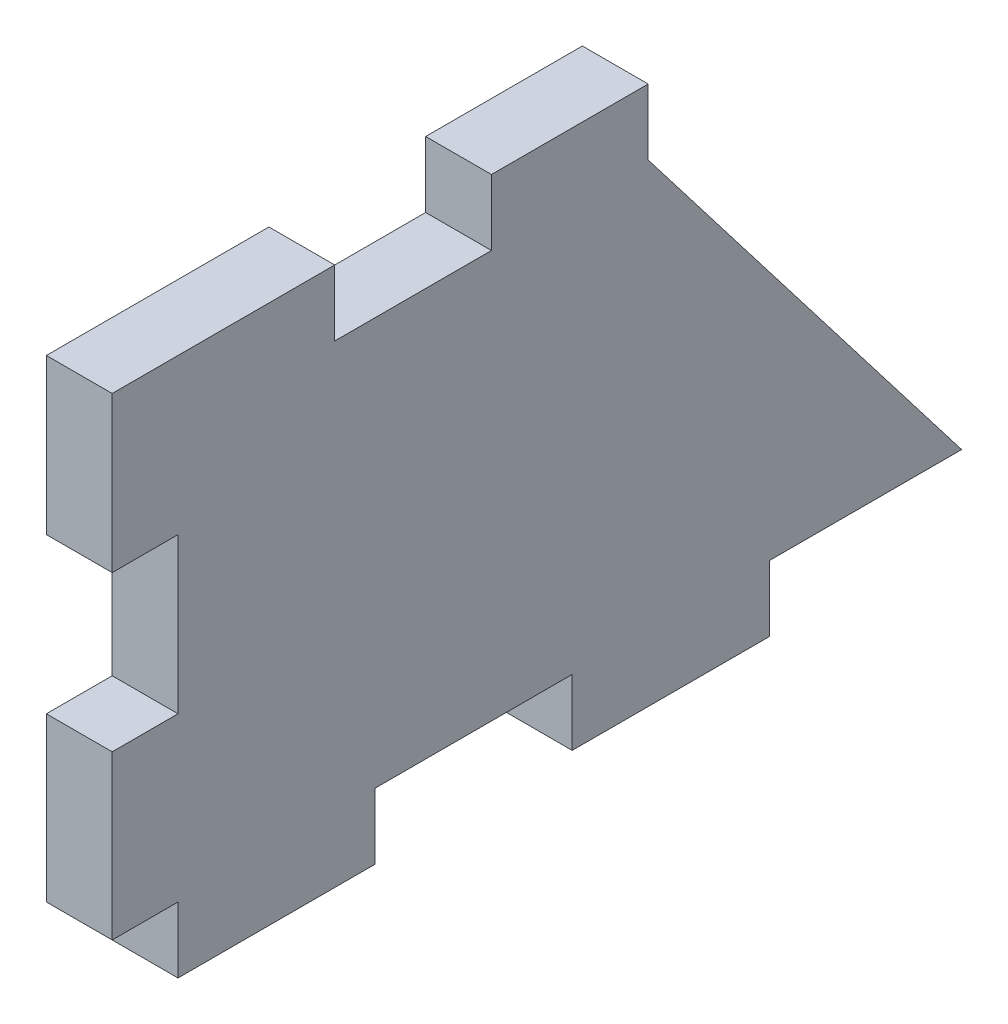
ISO-10303-21;
HEADER;
FILE_DESCRIPTION(('STEP AP214'),'2;1');
FILE_NAME('part.step','',(''),(''),'','','');
FILE_SCHEMA(('AUTOMOTIVE_DESIGN { 1 0 10303 214 1 1 1 1 }'));
ENDSEC;
DATA;
#1=APPLICATION_CONTEXT('core data for automotive mechanical design processes');
#2=APPLICATION_PROTOCOL_DEFINITION('international standard','automotive_design',2000,#1);
#3=PRODUCT_CONTEXT('',#1,'mechanical');
#4=PRODUCT('Part','Part','',(#3));
#5=PRODUCT_RELATED_PRODUCT_CATEGORY('part','',(#4));
#6=PRODUCT_DEFINITION_FORMATION('','',#4);
#7=PRODUCT_DEFINITION_CONTEXT('part definition',#1,'design');
#8=PRODUCT_DEFINITION('design','',#6,#7);
#9=PRODUCT_DEFINITION_SHAPE('','',#8);
#10=(LENGTH_UNIT() NAMED_UNIT(*) SI_UNIT(.MILLI.,.METRE.));
#11=(NAMED_UNIT(*) PLANE_ANGLE_UNIT() SI_UNIT($,.RADIAN.));
#12=(NAMED_UNIT(*) SI_UNIT($,.STERADIAN.) SOLID_ANGLE_UNIT());
#13=UNCERTAINTY_MEASURE_WITH_UNIT(LENGTH_MEASURE(1.E-05),#10,'distance_accuracy_value','');
#14=(GEOMETRIC_REPRESENTATION_CONTEXT(3) GLOBAL_UNCERTAINTY_ASSIGNED_CONTEXT((#13)) GLOBAL_UNIT_ASSIGNED_CONTEXT((#10,
#11,#12)) REPRESENTATION_CONTEXT('',''));
#15=CARTESIAN_POINT('',(0.,0.,0.));
#16=DIRECTION('',(0.,0.,1.));
#17=DIRECTION('',(1.,0.,0.));
#18=AXIS2_PLACEMENT_3D('',#15,#16,#17);
#19=CARTESIAN_POINT('',(5.334,-15.875,37.084));
#20=DIRECTION('',(0.,0.,1.));
#21=DIRECTION('',(1.,0.,0.));
#22=AXIS2_PLACEMENT_3D('',#19,#20,#21);
#23=PLANE('',#22);
#24=DIRECTION('',(-1.,0.,0.));
#25=VECTOR('',#24,1.);
#26=CARTESIAN_POINT('',(5.334,9.27099999999999,37.084));
#27=LINE('',#26,#25);
#28=CARTESIAN_POINT('',(5.334,9.27099999999999,37.084));
#29=VERTEX_POINT('',#28);
#30=CARTESIAN_POINT('',(0.,9.27099999999999,37.084));
#31=VERTEX_POINT('',#30);
#32=EDGE_CURVE('E44',#29,#31,#27,.T.);
#33=ORIENTED_EDGE('',*,*,#32,.F.);
#34=DIRECTION('',(0.,1.,0.));
#35=VECTOR('',#34,1.);
#36=CARTESIAN_POINT('',(5.334,-15.875,37.084));
#37=LINE('',#36,#35);
#38=CARTESIAN_POINT('',(5.334,21.844,37.084));
#39=VERTEX_POINT('',#38);
#40=EDGE_CURVE('E187',#29,#39,#37,.T.);
#41=ORIENTED_EDGE('',*,*,#40,.T.);
#42=DIRECTION('',(1.,0.,0.));
#43=VECTOR('',#42,1.);
#44=CARTESIAN_POINT('',(0.,21.844,37.084));
#45=LINE('',#44,#43);
#46=CARTESIAN_POINT('',(0.,21.844,37.084));
#47=VERTEX_POINT('',#46);
#48=EDGE_CURVE('E203',#47,#39,#45,.T.);
#49=ORIENTED_EDGE('',*,*,#48,.F.);
#50=DIRECTION('',(0.,1.,0.));
#51=VECTOR('',#50,1.);
#52=CARTESIAN_POINT('',(0.,-15.875,37.084));
#53=LINE('',#52,#51);
#54=EDGE_CURVE('E188',#31,#47,#53,.T.);
#55=ORIENTED_EDGE('',*,*,#54,.F.);
#56=EDGE_LOOP('',(#33,#41,#49,#55));
#57=FACE_BOUND('',#56,.T.);
#58=ADVANCED_FACE('F34',(#57),#23,.T.);
#59=CARTESIAN_POINT('',(5.334,-16.51,31.75));
#60=DIRECTION('',(0.,1.,0.));
#61=DIRECTION('',(0.,0.,1.));
#62=AXIS2_PLACEMENT_3D('',#59,#60,#61);
#63=PLANE('',#62);
#64=DIRECTION('',(0.,0.,-1.));
#65=VECTOR('',#64,1.);
#66=CARTESIAN_POINT('',(0.,-16.51,31.75));
#67=LINE('',#66,#65);
#68=CARTESIAN_POINT('',(0.,-16.51,15.7786782170306));
#69=VERTEX_POINT('',#68);
#70=CARTESIAN_POINT('',(0.,-16.51,-0.192643565938809));
#71=VERTEX_POINT('',#70);
#72=EDGE_CURVE('E284',#69,#71,#67,.T.);
#73=ORIENTED_EDGE('',*,*,#72,.T.);
#74=DIRECTION('',(-1.,0.,0.));
#75=VECTOR('',#74,1.);
#76=CARTESIAN_POINT('',(5.334,-16.51,-0.192643565938809));
#77=LINE('',#76,#75);
#78=CARTESIAN_POINT('',(5.334,-16.51,-0.192643565938809));
#79=VERTEX_POINT('',#78);
#80=EDGE_CURVE('E236',#79,#71,#77,.T.);
#81=ORIENTED_EDGE('',*,*,#80,.F.);
#82=DIRECTION('',(0.,0.,-1.));
#83=VECTOR('',#82,1.);
#84=CARTESIAN_POINT('',(5.334,-16.51,31.75));
#85=LINE('',#84,#83);
#86=CARTESIAN_POINT('',(5.334,-16.51,15.7786782170306));
#87=VERTEX_POINT('',#86);
#88=EDGE_CURVE('E302',#87,#79,#85,.T.);
#89=ORIENTED_EDGE('',*,*,#88,.F.);
#90=DIRECTION('',(-1.,0.,0.));
#91=VECTOR('',#90,1.);
#92=CARTESIAN_POINT('',(5.334,-16.51,15.7786782170306));
#93=LINE('',#92,#91);
#94=EDGE_CURVE('E257',#87,#69,#93,.T.);
#95=ORIENTED_EDGE('',*,*,#94,.T.);
#96=EDGE_LOOP('',(#73,#81,#89,#95));
#97=FACE_BOUND('',#96,.T.);
#98=ADVANCED_FACE('F393',(#97),#63,.F.);
#99=CARTESIAN_POINT('',(5.334,16.51,31.75));
#100=DIRECTION('',(0.,-1.,0.));
#101=DIRECTION('',(0.,0.,-1.));
#102=AXIS2_PLACEMENT_3D('',#99,#100,#101);
#103=PLANE('',#102);
#104=DIRECTION('',(0.,0.,1.));
#105=VECTOR('',#104,1.);
#106=CARTESIAN_POINT('',(5.334,16.51,31.75));
#107=LINE('',#106,#105);
#108=CARTESIAN_POINT('',(5.334,16.51,6.35000000000001));
#109=VERTEX_POINT('',#108);
#110=CARTESIAN_POINT('',(5.334,16.51,19.05));
#111=VERTEX_POINT('',#110);
#112=EDGE_CURVE('E299',#109,#111,#107,.T.);
#113=ORIENTED_EDGE('',*,*,#112,.F.);
#114=DIRECTION('',(-1.,0.,0.));
#115=VECTOR('',#114,1.);
#116=CARTESIAN_POINT('',(5.334,16.51,6.35000000000001));
#117=LINE('',#116,#115);
#118=CARTESIAN_POINT('',(0.,16.51,6.35000000000001));
#119=VERTEX_POINT('',#118);
#120=EDGE_CURVE('E362',#109,#119,#117,.T.);
#121=ORIENTED_EDGE('',*,*,#120,.T.);
#122=DIRECTION('',(0.,0.,1.));
#123=VECTOR('',#122,1.);
#124=CARTESIAN_POINT('',(0.,16.51,31.75));
#125=LINE('',#124,#123);
#126=CARTESIAN_POINT('',(0.,16.51,19.05));
#127=VERTEX_POINT('',#126);
#128=EDGE_CURVE('E308',#119,#127,#125,.T.);
#129=ORIENTED_EDGE('',*,*,#128,.T.);
#130=DIRECTION('',(-1.,0.,0.));
#131=VECTOR('',#130,1.);
#132=CARTESIAN_POINT('',(5.334,16.51,19.05));
#133=LINE('',#132,#131);
#134=EDGE_CURVE('E323',#111,#127,#133,.T.);
#135=ORIENTED_EDGE('',*,*,#134,.F.);
#136=EDGE_LOOP('',(#113,#121,#129,#135));
#137=FACE_BOUND('',#136,.T.);
#138=ADVANCED_FACE('F36',(#137),#103,.F.);
#139=CARTESIAN_POINT('',(5.334,-16.51,31.75));
#140=DIRECTION('',(0.,0.,-1.));
#141=DIRECTION('',(-1.,0.,0.));
#142=AXIS2_PLACEMENT_3D('',#139,#140,#141);
#143=PLANE('',#142);
#144=DIRECTION('',(0.,-1.,0.));
#145=VECTOR('',#144,1.);
#146=CARTESIAN_POINT('',(5.334,-16.51,31.75));
#147=LINE('',#146,#145);
#148=CARTESIAN_POINT('',(5.334,-16.51,31.75));
#149=VERTEX_POINT('',#148);
#150=CARTESIAN_POINT('',(5.334,-21.844,31.75));
#151=VERTEX_POINT('',#150);
#152=EDGE_CURVE('E38',#149,#151,#147,.T.);
#153=ORIENTED_EDGE('',*,*,#152,.F.);
#154=DIRECTION('',(1.,0.,0.));
#155=VECTOR('',#154,1.);
#156=CARTESIAN_POINT('',(0.,-16.51,31.75));
#157=LINE('',#156,#155);
#158=CARTESIAN_POINT('',(0.,-16.51,31.75));
#159=VERTEX_POINT('',#158);
#160=EDGE_CURVE('E55',#159,#149,#157,.T.);
#161=ORIENTED_EDGE('',*,*,#160,.F.);
#162=DIRECTION('',(0.,-1.,0.));
#163=VECTOR('',#162,1.);
#164=CARTESIAN_POINT('',(0.,-16.51,31.75));
#165=LINE('',#164,#163);
#166=CARTESIAN_POINT('',(0.,-21.844,31.75));
#167=VERTEX_POINT('',#166);
#168=EDGE_CURVE('E199',#159,#167,#165,.T.);
#169=ORIENTED_EDGE('',*,*,#168,.T.);
#170=DIRECTION('',(-1.,0.,0.));
#171=VECTOR('',#170,1.);
#172=CARTESIAN_POINT('',(5.334,-21.844,31.75));
#173=LINE('',#172,#171);
#174=EDGE_CURVE('E261',#151,#167,#173,.T.);
#175=ORIENTED_EDGE('',*,*,#174,.F.);
#176=EDGE_LOOP('',(#153,#161,#169,#175));
#177=FACE_BOUND('',#176,.T.);
#178=ADVANCED_FACE('F381',(#177),#143,.F.);
#179=CARTESIAN_POINT('',(5.334,-16.51,-16.1639653489082));
#180=VERTEX_POINT('',#179);
#181=CARTESIAN_POINT('',(5.334,-16.51,-31.75));
#182=VERTEX_POINT('',#181);
#183=EDGE_CURVE('E285',#180,#182,#85,.T.);
#184=ORIENTED_EDGE('',*,*,#183,.F.);
#185=DIRECTION('',(-1.,0.,0.));
#186=VECTOR('',#185,1.);
#187=CARTESIAN_POINT('',(5.334,-16.51,-16.1639653489082));
#188=LINE('',#187,#186);
#189=CARTESIAN_POINT('',(0.,-16.51,-16.1639653489082));
#190=VERTEX_POINT('',#189);
#191=EDGE_CURVE('E249',#180,#190,#188,.T.);
#192=ORIENTED_EDGE('',*,*,#191,.T.);
#193=CARTESIAN_POINT('',(0.,-16.51,-31.75));
#194=VERTEX_POINT('',#193);
#195=EDGE_CURVE('E281',#190,#194,#67,.T.);
#196=ORIENTED_EDGE('',*,*,#195,.T.);
#197=DIRECTION('',(-1.,0.,0.));
#198=VECTOR('',#197,1.);
#199=CARTESIAN_POINT('',(5.334,-16.51,-31.75));
#200=LINE('',#199,#198);
#201=EDGE_CURVE('E293',#182,#194,#200,.T.);
#202=ORIENTED_EDGE('',*,*,#201,.F.);
#203=EDGE_LOOP('',(#184,#192,#196,#202));
#204=FACE_BOUND('',#203,.T.);
#205=ADVANCED_FACE('F408',(#204),#63,.F.);
#206=CARTESIAN_POINT('',(5.334,16.51,-31.75));
#207=DIRECTION('',(-1.,0.,0.));
#208=DIRECTION('',(0.,0.,1.));
#209=AXIS2_PLACEMENT_3D('',#206,#207,#208);
#210=PLANE('',#209);
#211=DIRECTION('',(0.,0.,-1.));
#212=VECTOR('',#211,1.);
#213=CARTESIAN_POINT('',(5.334,-16.51,31.75));
#214=LINE('',#213,#212);
#215=CARTESIAN_POINT('',(5.334,-16.51,37.084));
#216=VERTEX_POINT('',#215);
#217=EDGE_CURVE('E195',#216,#149,#214,.T.);
#218=ORIENTED_EDGE('',*,*,#217,.T.);
#219=ORIENTED_EDGE('',*,*,#152,.T.);
#220=DIRECTION('',(0.,0.,1.));
#221=VECTOR('',#220,1.);
#222=CARTESIAN_POINT('',(5.334,-21.844,31.75));
#223=LINE('',#222,#221);
#224=CARTESIAN_POINT('',(5.334,-21.844,15.7786782170306));
#225=VERTEX_POINT('',#224);
#226=EDGE_CURVE('E254',#225,#151,#223,.T.);
#227=ORIENTED_EDGE('',*,*,#226,.F.);
#228=DIRECTION('',(0.,-1.,0.));
#229=VECTOR('',#228,1.);
#230=CARTESIAN_POINT('',(5.334,-16.51,15.7786782170306));
#231=LINE('',#230,#229);
#232=EDGE_CURVE('E258',#87,#225,#231,.T.);
#233=ORIENTED_EDGE('',*,*,#232,.F.);
#234=ORIENTED_EDGE('',*,*,#88,.T.);
#235=DIRECTION('',(0.,1.,0.));
#236=VECTOR('',#235,1.);
#237=CARTESIAN_POINT('',(5.334,-16.51,-0.192643565938809));
#238=LINE('',#237,#236);
#239=CARTESIAN_POINT('',(5.334,-21.844,-0.192643565938809));
#240=VERTEX_POINT('',#239);
#241=EDGE_CURVE('E226',#240,#79,#238,.T.);
#242=ORIENTED_EDGE('',*,*,#241,.F.);
#243=DIRECTION('',(0.,0.,1.));
#244=VECTOR('',#243,1.);
#245=CARTESIAN_POINT('',(5.334,-21.844,-0.192643565938809));
#246=LINE('',#245,#244);
#247=CARTESIAN_POINT('',(5.334,-21.844,-16.1639653489082));
#248=VERTEX_POINT('',#247);
#249=EDGE_CURVE('E233',#248,#240,#246,.T.);
#250=ORIENTED_EDGE('',*,*,#249,.F.);
#251=DIRECTION('',(0.,-1.,0.));
#252=VECTOR('',#251,1.);
#253=CARTESIAN_POINT('',(5.334,-16.51,-16.1639653489082));
#254=LINE('',#253,#252);
#255=EDGE_CURVE('E229',#180,#248,#254,.T.);
#256=ORIENTED_EDGE('',*,*,#255,.F.);
#257=ORIENTED_EDGE('',*,*,#183,.T.);
#258=DIRECTION('',(0.,0.7926239891046,0.609710760849693));
#259=VECTOR('',#258,1.);
#260=CARTESIAN_POINT('',(5.334,-16.51,-31.75));
#261=LINE('',#260,#259);
#262=CARTESIAN_POINT('',(5.334,16.51,-6.34999999999998));
#263=VERTEX_POINT('',#262);
#264=EDGE_CURVE('E332',#182,#263,#261,.T.);
#265=ORIENTED_EDGE('',*,*,#264,.T.);
#266=DIRECTION('',(0.,-1.,0.));
#267=VECTOR('',#266,1.);
#268=CARTESIAN_POINT('',(5.334,16.51,-6.34999999999998));
#269=LINE('',#268,#267);
#270=CARTESIAN_POINT('',(5.334,21.844,-6.34999999999998));
#271=VERTEX_POINT('',#270);
#272=EDGE_CURVE('E269',#271,#263,#269,.T.);
#273=ORIENTED_EDGE('',*,*,#272,.F.);
#274=DIRECTION('',(0.,0.,-1.));
#275=VECTOR('',#274,1.);
#276=CARTESIAN_POINT('',(5.334,21.844,-6.34999999999998));
#277=LINE('',#276,#275);
#278=CARTESIAN_POINT('',(5.334,21.844,6.35000000000001));
#279=VERTEX_POINT('',#278);
#280=EDGE_CURVE('E355',#279,#271,#277,.T.);
#281=ORIENTED_EDGE('',*,*,#280,.F.);
#282=DIRECTION('',(0.,1.,0.));
#283=VECTOR('',#282,1.);
#284=CARTESIAN_POINT('',(5.334,16.51,6.35000000000001));
#285=LINE('',#284,#283);
#286=EDGE_CURVE('E415',#109,#279,#285,.T.);
#287=ORIENTED_EDGE('',*,*,#286,.F.);
#288=ORIENTED_EDGE('',*,*,#112,.T.);
#289=DIRECTION('',(0.,-1.,0.));
#290=VECTOR('',#289,1.);
#291=CARTESIAN_POINT('',(5.334,16.51,19.05));
#292=LINE('',#291,#290);
#293=CARTESIAN_POINT('',(5.334,21.844,19.05));
#294=VERTEX_POINT('',#293);
#295=EDGE_CURVE('E313',#294,#111,#292,.T.);
#296=ORIENTED_EDGE('',*,*,#295,.F.);
#297=DIRECTION('',(0.,0.,-1.));
#298=VECTOR('',#297,1.);
#299=CARTESIAN_POINT('',(5.334,21.844,31.75));
#300=LINE('',#299,#298);
#301=EDGE_CURVE('E317',#39,#294,#300,.T.);
#302=ORIENTED_EDGE('',*,*,#301,.F.);
#303=ORIENTED_EDGE('',*,*,#40,.F.);
#304=DIRECTION('',(0.,0.,1.));
#305=VECTOR('',#304,1.);
#306=CARTESIAN_POINT('',(5.334,9.27099999999999,37.084));
#307=LINE('',#306,#305);
#308=CARTESIAN_POINT('',(5.334,9.27099999999999,31.75));
#309=VERTEX_POINT('',#308);
#310=EDGE_CURVE('E213',#309,#29,#307,.T.);
#311=ORIENTED_EDGE('',*,*,#310,.F.);
#312=DIRECTION('',(0.,1.,0.));
#313=VECTOR('',#312,1.);
#314=CARTESIAN_POINT('',(5.334,-3.30200000000001,31.75));
#315=LINE('',#314,#313);
#316=CARTESIAN_POINT('',(5.334,-3.30200000000001,31.75));
#317=VERTEX_POINT('',#316);
#318=EDGE_CURVE('E210',#317,#309,#315,.T.);
#319=ORIENTED_EDGE('',*,*,#318,.F.);
#320=DIRECTION('',(0.,0.,-1.));
#321=VECTOR('',#320,1.);
#322=CARTESIAN_POINT('',(5.334,-3.30200000000001,37.084));
#323=LINE('',#322,#321);
#324=CARTESIAN_POINT('',(5.334,-3.30200000000001,37.084));
#325=VERTEX_POINT('',#324);
#326=EDGE_CURVE('E207',#325,#317,#323,.T.);
#327=ORIENTED_EDGE('',*,*,#326,.F.);
#328=EDGE_CURVE('E223',#216,#325,#37,.T.);
#329=ORIENTED_EDGE('',*,*,#328,.F.);
#330=EDGE_LOOP('',(#218,#219,#227,#233,#234,#242,#250,#256,#257,#265,#273,#281,#287,#288,#296,
#302,#303,#311,#319,#327,#329));
#331=FACE_BOUND('',#330,.T.);
#332=ADVANCED_FACE('F372',(#331),#210,.F.);
#333=CARTESIAN_POINT('',(0.,16.51,-31.75));
#334=DIRECTION('',(-1.,0.,0.));
#335=DIRECTION('',(0.,0.,1.));
#336=AXIS2_PLACEMENT_3D('',#333,#334,#335);
#337=PLANE('',#336);
#338=ORIENTED_EDGE('',*,*,#168,.F.);
#339=DIRECTION('',(0.,0.,-1.));
#340=VECTOR('',#339,1.);
#341=CARTESIAN_POINT('',(0.,-16.51,31.75));
#342=LINE('',#341,#340);
#343=CARTESIAN_POINT('',(0.,-16.51,37.084));
#344=VERTEX_POINT('',#343);
#345=EDGE_CURVE('E193',#344,#159,#342,.T.);
#346=ORIENTED_EDGE('',*,*,#345,.F.);
#347=CARTESIAN_POINT('',(0.,-3.30200000000001,37.084));
#348=VERTEX_POINT('',#347);
#349=EDGE_CURVE('E177',#344,#348,#53,.T.);
#350=ORIENTED_EDGE('',*,*,#349,.T.);
#351=DIRECTION('',(0.,0.,1.));
#352=VECTOR('',#351,1.);
#353=CARTESIAN_POINT('',(0.,-3.30200000000001,-31.75));
#354=LINE('',#353,#352);
#355=CARTESIAN_POINT('',(0.,-3.30200000000001,31.75));
#356=VERTEX_POINT('',#355);
#357=EDGE_CURVE('E218',#356,#348,#354,.T.);
#358=ORIENTED_EDGE('',*,*,#357,.F.);
#359=DIRECTION('',(0.,-1.,0.));
#360=VECTOR('',#359,1.);
#361=CARTESIAN_POINT('',(0.,16.51,31.75));
#362=LINE('',#361,#360);
#363=CARTESIAN_POINT('',(0.,9.27099999999999,31.75));
#364=VERTEX_POINT('',#363);
#365=EDGE_CURVE('E11',#364,#356,#362,.T.);
#366=ORIENTED_EDGE('',*,*,#365,.F.);
#367=DIRECTION('',(0.,0.,-1.));
#368=VECTOR('',#367,1.);
#369=CARTESIAN_POINT('',(0.,9.27099999999999,-31.75));
#370=LINE('',#369,#368);
#371=EDGE_CURVE('E221',#31,#364,#370,.T.);
#372=ORIENTED_EDGE('',*,*,#371,.F.);
#373=ORIENTED_EDGE('',*,*,#54,.T.);
#374=DIRECTION('',(0.,0.,-1.));
#375=VECTOR('',#374,1.);
#376=CARTESIAN_POINT('',(0.,21.844,31.75));
#377=LINE('',#376,#375);
#378=CARTESIAN_POINT('',(0.,21.844,19.05));
#379=VERTEX_POINT('',#378);
#380=EDGE_CURVE('E322',#47,#379,#377,.T.);
#381=ORIENTED_EDGE('',*,*,#380,.T.);
#382=DIRECTION('',(0.,-1.,0.));
#383=VECTOR('',#382,1.);
#384=CARTESIAN_POINT('',(0.,16.51,19.05));
#385=LINE('',#384,#383);
#386=EDGE_CURVE('E320',#379,#127,#385,.T.);
#387=ORIENTED_EDGE('',*,*,#386,.T.);
#388=ORIENTED_EDGE('',*,*,#128,.F.);
#389=DIRECTION('',(0.,1.,0.));
#390=VECTOR('',#389,1.);
#391=CARTESIAN_POINT('',(0.,16.51,6.35000000000001));
#392=LINE('',#391,#390);
#393=CARTESIAN_POINT('',(0.,21.844,6.35000000000001));
#394=VERTEX_POINT('',#393);
#395=EDGE_CURVE('E351',#119,#394,#392,.T.);
#396=ORIENTED_EDGE('',*,*,#395,.T.);
#397=DIRECTION('',(0.,0.,-1.));
#398=VECTOR('',#397,1.);
#399=CARTESIAN_POINT('',(0.,21.844,-6.34999999999998));
#400=LINE('',#399,#398);
#401=CARTESIAN_POINT('',(0.,21.844,-6.34999999999998));
#402=VERTEX_POINT('',#401);
#403=EDGE_CURVE('E350',#394,#402,#400,.T.);
#404=ORIENTED_EDGE('',*,*,#403,.T.);
#405=DIRECTION('',(0.,-1.,0.));
#406=VECTOR('',#405,1.);
#407=CARTESIAN_POINT('',(0.,16.51,-6.34999999999998));
#408=LINE('',#407,#406);
#409=CARTESIAN_POINT('',(0.,16.51,-6.34999999999998));
#410=VERTEX_POINT('',#409);
#411=EDGE_CURVE('E264',#402,#410,#408,.T.);
#412=ORIENTED_EDGE('',*,*,#411,.T.);
#413=DIRECTION('',(0.,0.7926239891046,0.609710760849693));
#414=VECTOR('',#413,1.);
#415=CARTESIAN_POINT('',(0.,-16.51,-31.75));
#416=LINE('',#415,#414);
#417=EDGE_CURVE('E326',#194,#410,#416,.T.);
#418=ORIENTED_EDGE('',*,*,#417,.F.);
#419=ORIENTED_EDGE('',*,*,#195,.F.);
#420=DIRECTION('',(0.,-1.,0.));
#421=VECTOR('',#420,1.);
#422=CARTESIAN_POINT('',(0.,-16.51,-16.1639653489082));
#423=LINE('',#422,#421);
#424=CARTESIAN_POINT('',(0.,-21.844,-16.1639653489082));
#425=VERTEX_POINT('',#424);
#426=EDGE_CURVE('E239',#190,#425,#423,.T.);
#427=ORIENTED_EDGE('',*,*,#426,.T.);
#428=DIRECTION('',(0.,0.,1.));
#429=VECTOR('',#428,1.);
#430=CARTESIAN_POINT('',(0.,-21.844,-0.192643565938809));
#431=LINE('',#430,#429);
#432=CARTESIAN_POINT('',(0.,-21.844,-0.192643565938809));
#433=VERTEX_POINT('',#432);
#434=EDGE_CURVE('E230',#425,#433,#431,.T.);
#435=ORIENTED_EDGE('',*,*,#434,.T.);
#436=DIRECTION('',(0.,1.,0.));
#437=VECTOR('',#436,1.);
#438=CARTESIAN_POINT('',(0.,-16.51,-0.192643565938809));
#439=LINE('',#438,#437);
#440=EDGE_CURVE('E224',#433,#71,#439,.T.);
#441=ORIENTED_EDGE('',*,*,#440,.T.);
#442=ORIENTED_EDGE('',*,*,#72,.F.);
#443=DIRECTION('',(0.,-1.,0.));
#444=VECTOR('',#443,1.);
#445=CARTESIAN_POINT('',(0.,-16.51,15.7786782170306));
#446=LINE('',#445,#444);
#447=CARTESIAN_POINT('',(0.,-21.844,15.7786782170306));
#448=VERTEX_POINT('',#447);
#449=EDGE_CURVE('E246',#69,#448,#446,.T.);
#450=ORIENTED_EDGE('',*,*,#449,.T.);
#451=DIRECTION('',(0.,0.,1.));
#452=VECTOR('',#451,1.);
#453=CARTESIAN_POINT('',(0.,-21.844,31.75));
#454=LINE('',#453,#452);
#455=EDGE_CURVE('E259',#448,#167,#454,.T.);
#456=ORIENTED_EDGE('',*,*,#455,.T.);
#457=EDGE_LOOP('',(#338,#346,#350,#358,#366,#372,#373,#381,#387,#388,#396,#404,#412,#418,#419,
#427,#435,#441,#442,#450,#456));
#458=FACE_BOUND('',#457,.T.);
#459=ADVANCED_FACE('F197',(#458),#337,.T.);
#460=CARTESIAN_POINT('',(5.334,-16.51,-31.75));
#461=DIRECTION('',(0.,-0.609710760849693,0.7926239891046));
#462=DIRECTION('',(0.,-0.7926239891046,-0.609710760849693));
#463=AXIS2_PLACEMENT_3D('',#460,#461,#462);
#464=PLANE('',#463);
#465=ORIENTED_EDGE('',*,*,#417,.T.);
#466=DIRECTION('',(-1.,0.,0.));
#467=VECTOR('',#466,1.);
#468=CARTESIAN_POINT('',(5.334,16.51,-6.34999999999998));
#469=LINE('',#468,#467);
#470=EDGE_CURVE('E310',#263,#410,#469,.T.);
#471=ORIENTED_EDGE('',*,*,#470,.F.);
#472=ORIENTED_EDGE('',*,*,#264,.F.);
#473=ORIENTED_EDGE('',*,*,#201,.T.);
#474=EDGE_LOOP('',(#465,#471,#472,#473));
#475=FACE_BOUND('',#474,.T.);
#476=ADVANCED_FACE('F478',(#475),#464,.F.);
#477=CARTESIAN_POINT('',(5.334,16.51,19.05));
#478=DIRECTION('',(0.,0.,-1.));
#479=DIRECTION('',(-1.,0.,0.));
#480=AXIS2_PLACEMENT_3D('',#477,#478,#479);
#481=PLANE('',#480);
#482=ORIENTED_EDGE('',*,*,#386,.F.);
#483=DIRECTION('',(-1.,0.,0.));
#484=VECTOR('',#483,1.);
#485=CARTESIAN_POINT('',(5.334,21.844,19.05));
#486=LINE('',#485,#484);
#487=EDGE_CURVE('E316',#294,#379,#486,.T.);
#488=ORIENTED_EDGE('',*,*,#487,.F.);
#489=ORIENTED_EDGE('',*,*,#295,.T.);
#490=ORIENTED_EDGE('',*,*,#134,.T.);
#491=EDGE_LOOP('',(#482,#488,#489,#490));
#492=FACE_BOUND('',#491,.T.);
#493=ADVANCED_FACE('F420',(#492),#481,.T.);
#494=CARTESIAN_POINT('',(5.334,21.844,31.75));
#495=DIRECTION('',(0.,1.,0.));
#496=DIRECTION('',(0.,0.,1.));
#497=AXIS2_PLACEMENT_3D('',#494,#495,#496);
#498=PLANE('',#497);
#499=ORIENTED_EDGE('',*,*,#380,.F.);
#500=ORIENTED_EDGE('',*,*,#48,.T.);
#501=ORIENTED_EDGE('',*,*,#301,.T.);
#502=ORIENTED_EDGE('',*,*,#487,.T.);
#503=EDGE_LOOP('',(#499,#500,#501,#502));
#504=FACE_BOUND('',#503,.T.);
#505=ADVANCED_FACE('F365',(#504),#498,.T.);
#506=CARTESIAN_POINT('',(5.334,16.51,-6.34999999999998));
#507=DIRECTION('',(0.,0.,-1.));
#508=DIRECTION('',(-1.,0.,0.));
#509=AXIS2_PLACEMENT_3D('',#506,#507,#508);
#510=PLANE('',#509);
#511=ORIENTED_EDGE('',*,*,#411,.F.);
#512=DIRECTION('',(-1.,0.,0.));
#513=VECTOR('',#512,1.);
#514=CARTESIAN_POINT('',(5.334,21.844,-6.34999999999998));
#515=LINE('',#514,#513);
#516=EDGE_CURVE('E358',#271,#402,#515,.T.);
#517=ORIENTED_EDGE('',*,*,#516,.F.);
#518=ORIENTED_EDGE('',*,*,#272,.T.);
#519=ORIENTED_EDGE('',*,*,#470,.T.);
#520=EDGE_LOOP('',(#511,#517,#518,#519));
#521=FACE_BOUND('',#520,.T.);
#522=ADVANCED_FACE('F342',(#521),#510,.T.);
#523=CARTESIAN_POINT('',(5.334,21.844,-6.34999999999998));
#524=DIRECTION('',(0.,1.,0.));
#525=DIRECTION('',(0.,0.,1.));
#526=AXIS2_PLACEMENT_3D('',#523,#524,#525);
#527=PLANE('',#526);
#528=ORIENTED_EDGE('',*,*,#403,.F.);
#529=DIRECTION('',(-1.,0.,0.));
#530=VECTOR('',#529,1.);
#531=CARTESIAN_POINT('',(5.334,21.844,6.35000000000001));
#532=LINE('',#531,#530);
#533=EDGE_CURVE('E360',#279,#394,#532,.T.);
#534=ORIENTED_EDGE('',*,*,#533,.F.);
#535=ORIENTED_EDGE('',*,*,#280,.T.);
#536=ORIENTED_EDGE('',*,*,#516,.T.);
#537=EDGE_LOOP('',(#528,#534,#535,#536));
#538=FACE_BOUND('',#537,.T.);
#539=ADVANCED_FACE('F467',(#538),#527,.T.);
#540=CARTESIAN_POINT('',(5.334,16.51,6.35000000000001));
#541=DIRECTION('',(0.,0.,1.));
#542=DIRECTION('',(1.,0.,0.));
#543=AXIS2_PLACEMENT_3D('',#540,#541,#542);
#544=PLANE('',#543);
#545=ORIENTED_EDGE('',*,*,#395,.F.);
#546=ORIENTED_EDGE('',*,*,#120,.F.);
#547=ORIENTED_EDGE('',*,*,#286,.T.);
#548=ORIENTED_EDGE('',*,*,#533,.T.);
#549=EDGE_LOOP('',(#545,#546,#547,#548));
#550=FACE_BOUND('',#549,.T.);
#551=ADVANCED_FACE('F464',(#550),#544,.T.);
#552=CARTESIAN_POINT('',(5.334,-21.844,31.75));
#553=DIRECTION('',(0.,-1.,0.));
#554=DIRECTION('',(0.,0.,-1.));
#555=AXIS2_PLACEMENT_3D('',#552,#553,#554);
#556=PLANE('',#555);
#557=ORIENTED_EDGE('',*,*,#455,.F.);
#558=DIRECTION('',(-1.,0.,0.));
#559=VECTOR('',#558,1.);
#560=CARTESIAN_POINT('',(5.334,-21.844,15.7786782170306));
#561=LINE('',#560,#559);
#562=EDGE_CURVE('E265',#225,#448,#561,.T.);
#563=ORIENTED_EDGE('',*,*,#562,.F.);
#564=ORIENTED_EDGE('',*,*,#226,.T.);
#565=ORIENTED_EDGE('',*,*,#174,.T.);
#566=EDGE_LOOP('',(#557,#563,#564,#565));
#567=FACE_BOUND('',#566,.T.);
#568=ADVANCED_FACE('F384',(#567),#556,.T.);
#569=CARTESIAN_POINT('',(5.334,-16.51,15.7786782170306));
#570=DIRECTION('',(0.,0.,-1.));
#571=DIRECTION('',(-1.,0.,0.));
#572=AXIS2_PLACEMENT_3D('',#569,#570,#571);
#573=PLANE('',#572);
#574=ORIENTED_EDGE('',*,*,#449,.F.);
#575=ORIENTED_EDGE('',*,*,#94,.F.);
#576=ORIENTED_EDGE('',*,*,#232,.T.);
#577=ORIENTED_EDGE('',*,*,#562,.T.);
#578=EDGE_LOOP('',(#574,#575,#576,#577));
#579=FACE_BOUND('',#578,.T.);
#580=ADVANCED_FACE('F389',(#579),#573,.T.);
#581=CARTESIAN_POINT('',(5.334,-16.51,-0.192643565938809));
#582=DIRECTION('',(0.,0.,1.));
#583=DIRECTION('',(1.,0.,0.));
#584=AXIS2_PLACEMENT_3D('',#581,#582,#583);
#585=PLANE('',#584);
#586=ORIENTED_EDGE('',*,*,#440,.F.);
#587=DIRECTION('',(-1.,0.,0.));
#588=VECTOR('',#587,1.);
#589=CARTESIAN_POINT('',(5.334,-21.844,-0.192643565938809));
#590=LINE('',#589,#588);
#591=EDGE_CURVE('E244',#240,#433,#590,.T.);
#592=ORIENTED_EDGE('',*,*,#591,.F.);
#593=ORIENTED_EDGE('',*,*,#241,.T.);
#594=ORIENTED_EDGE('',*,*,#80,.T.);
#595=EDGE_LOOP('',(#586,#592,#593,#594));
#596=FACE_BOUND('',#595,.T.);
#597=ADVANCED_FACE('F398',(#596),#585,.T.);
#598=CARTESIAN_POINT('',(5.334,-21.844,-0.192643565938809));
#599=DIRECTION('',(0.,-1.,0.));
#600=DIRECTION('',(0.,0.,-1.));
#601=AXIS2_PLACEMENT_3D('',#598,#599,#600);
#602=PLANE('',#601);
#603=ORIENTED_EDGE('',*,*,#434,.F.);
#604=DIRECTION('',(-1.,0.,0.));
#605=VECTOR('',#604,1.);
#606=CARTESIAN_POINT('',(5.334,-21.844,-16.1639653489082));
#607=LINE('',#606,#605);
#608=EDGE_CURVE('E247',#248,#425,#607,.T.);
#609=ORIENTED_EDGE('',*,*,#608,.F.);
#610=ORIENTED_EDGE('',*,*,#249,.T.);
#611=ORIENTED_EDGE('',*,*,#591,.T.);
#612=EDGE_LOOP('',(#603,#609,#610,#611));
#613=FACE_BOUND('',#612,.T.);
#614=ADVANCED_FACE('F401',(#613),#602,.T.);
#615=CARTESIAN_POINT('',(5.334,-16.51,-16.1639653489082));
#616=DIRECTION('',(0.,0.,-1.));
#617=DIRECTION('',(-1.,0.,0.));
#618=AXIS2_PLACEMENT_3D('',#615,#616,#617);
#619=PLANE('',#618);
#620=ORIENTED_EDGE('',*,*,#426,.F.);
#621=ORIENTED_EDGE('',*,*,#191,.F.);
#622=ORIENTED_EDGE('',*,*,#255,.T.);
#623=ORIENTED_EDGE('',*,*,#608,.T.);
#624=EDGE_LOOP('',(#620,#621,#622,#623));
#625=FACE_BOUND('',#624,.T.);
#626=ADVANCED_FACE('F406',(#625),#619,.T.);
#627=DIRECTION('',(1.,0.,0.));
#628=VECTOR('',#627,1.);
#629=CARTESIAN_POINT('',(5.334,-3.30200000000001,37.084));
#630=LINE('',#629,#628);
#631=EDGE_CURVE('E183',#348,#325,#630,.T.);
#632=ORIENTED_EDGE('',*,*,#631,.F.);
#633=ORIENTED_EDGE('',*,*,#349,.F.);
#634=DIRECTION('',(1.,0.,0.));
#635=VECTOR('',#634,1.);
#636=CARTESIAN_POINT('',(0.,-16.51,37.084));
#637=LINE('',#636,#635);
#638=EDGE_CURVE('E181',#344,#216,#637,.T.);
#639=ORIENTED_EDGE('',*,*,#638,.T.);
#640=ORIENTED_EDGE('',*,*,#328,.T.);
#641=EDGE_LOOP('',(#632,#633,#639,#640));
#642=FACE_BOUND('',#641,.T.);
#643=ADVANCED_FACE('F179',(#642),#23,.T.);
#644=CARTESIAN_POINT('',(-4.99999999997031E-05,9.27099999999999,37.084));
#645=DIRECTION('',(0.,1.,0.));
#646=DIRECTION('',(0.,0.,1.));
#647=AXIS2_PLACEMENT_3D('',#644,#645,#646);
#648=PLANE('',#647);
#649=ORIENTED_EDGE('',*,*,#371,.T.);
#650=DIRECTION('',(1.,0.,0.));
#651=VECTOR('',#650,1.);
#652=CARTESIAN_POINT('',(-4.99999999997031E-05,9.27099999999999,31.75));
#653=LINE('',#652,#651);
#654=EDGE_CURVE('E216',#364,#309,#653,.T.);
#655=ORIENTED_EDGE('',*,*,#654,.T.);
#656=ORIENTED_EDGE('',*,*,#310,.T.);
#657=ORIENTED_EDGE('',*,*,#32,.T.);
#658=EDGE_LOOP('',(#649,#655,#656,#657));
#659=FACE_BOUND('',#658,.T.);
#660=ADVANCED_FACE('F424',(#659),#648,.F.);
#661=CARTESIAN_POINT('',(-4.99999999997031E-05,-3.30200000000001,31.75));
#662=DIRECTION('',(0.,0.,-1.));
#663=DIRECTION('',(-1.,0.,0.));
#664=AXIS2_PLACEMENT_3D('',#661,#662,#663);
#665=PLANE('',#664);
#666=ORIENTED_EDGE('',*,*,#365,.T.);
#667=DIRECTION('',(1.,0.,0.));
#668=VECTOR('',#667,1.);
#669=CARTESIAN_POINT('',(-4.99999999997031E-05,-3.30200000000001,31.75));
#670=LINE('',#669,#668);
#671=EDGE_CURVE('E215',#356,#317,#670,.T.);
#672=ORIENTED_EDGE('',*,*,#671,.T.);
#673=ORIENTED_EDGE('',*,*,#318,.T.);
#674=ORIENTED_EDGE('',*,*,#654,.F.);
#675=EDGE_LOOP('',(#666,#672,#673,#674));
#676=FACE_BOUND('',#675,.T.);
#677=ADVANCED_FACE('F426',(#676),#665,.F.);
#678=CARTESIAN_POINT('',(-4.99999999997031E-05,-3.30200000000001,37.084));
#679=DIRECTION('',(0.,-1.,0.));
#680=DIRECTION('',(0.,0.,-1.));
#681=AXIS2_PLACEMENT_3D('',#678,#679,#680);
#682=PLANE('',#681);
#683=ORIENTED_EDGE('',*,*,#357,.T.);
#684=ORIENTED_EDGE('',*,*,#631,.T.);
#685=ORIENTED_EDGE('',*,*,#326,.T.);
#686=ORIENTED_EDGE('',*,*,#671,.F.);
#687=EDGE_LOOP('',(#683,#684,#685,#686));
#688=FACE_BOUND('',#687,.T.);
#689=ADVANCED_FACE('F431',(#688),#682,.F.);
#690=CARTESIAN_POINT('',(0.,-16.51,31.75));
#691=DIRECTION('',(0.,-1.,0.));
#692=DIRECTION('',(0.,0.,-1.));
#693=AXIS2_PLACEMENT_3D('',#690,#691,#692);
#694=PLANE('',#693);
#695=ORIENTED_EDGE('',*,*,#217,.F.);
#696=ORIENTED_EDGE('',*,*,#638,.F.);
#697=ORIENTED_EDGE('',*,*,#345,.T.);
#698=ORIENTED_EDGE('',*,*,#160,.T.);
#699=EDGE_LOOP('',(#695,#696,#697,#698));
#700=FACE_BOUND('',#699,.T.);
#701=ADVANCED_FACE('F192',(#700),#694,.T.);
#702=CLOSED_SHELL('',(#58,#98,#138,#178,#205,#332,#459,#476,#493,#505,#522,#539,#551,#568,#580,
#597,#614,#626,#643,#660,#677,#689,#701));
#703=MANIFOLD_SOLID_BREP('B2',#702);
#704=ADVANCED_BREP_SHAPE_REPRESENTATION('',(#18,#703),#14);
#705=SHAPE_DEFINITION_REPRESENTATION(#9,#704);
ENDSEC;
END-ISO-10303-21;
